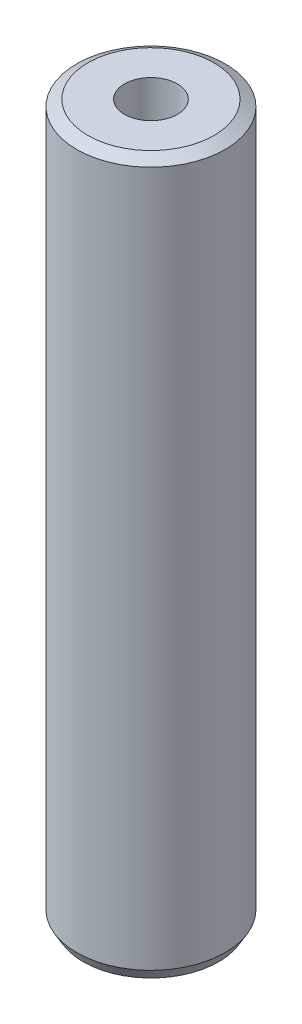
ISO-10303-21;
HEADER;
FILE_DESCRIPTION(('STEP AP214'),'2;1');
FILE_NAME('part.step','',(''),(''),'','','');
FILE_SCHEMA(('AUTOMOTIVE_DESIGN { 1 0 10303 214 1 1 1 1 }'));
ENDSEC;
DATA;
#1=APPLICATION_CONTEXT('core data for automotive mechanical design processes');
#2=APPLICATION_PROTOCOL_DEFINITION('international standard','automotive_design',2000,#1);
#3=PRODUCT_CONTEXT('',#1,'mechanical');
#4=PRODUCT('Part','Part','',(#3));
#5=PRODUCT_RELATED_PRODUCT_CATEGORY('part','',(#4));
#6=PRODUCT_DEFINITION_FORMATION('','',#4);
#7=PRODUCT_DEFINITION_CONTEXT('part definition',#1,'design');
#8=PRODUCT_DEFINITION('design','',#6,#7);
#9=PRODUCT_DEFINITION_SHAPE('','',#8);
#10=(LENGTH_UNIT() NAMED_UNIT(*) SI_UNIT(.MILLI.,.METRE.));
#11=(NAMED_UNIT(*) PLANE_ANGLE_UNIT() SI_UNIT($,.RADIAN.));
#12=(NAMED_UNIT(*) SI_UNIT($,.STERADIAN.) SOLID_ANGLE_UNIT());
#13=UNCERTAINTY_MEASURE_WITH_UNIT(LENGTH_MEASURE(1.E-05),#10,'distance_accuracy_value','');
#14=(GEOMETRIC_REPRESENTATION_CONTEXT(3) GLOBAL_UNCERTAINTY_ASSIGNED_CONTEXT((#13)) GLOBAL_UNIT_ASSIGNED_CONTEXT((#10,
#11,#12)) REPRESENTATION_CONTEXT('',''));
#15=CARTESIAN_POINT('',(0.,0.,0.));
#16=DIRECTION('',(0.,0.,1.));
#17=DIRECTION('',(1.,0.,0.));
#18=AXIS2_PLACEMENT_3D('',#15,#16,#17);
#19=CARTESIAN_POINT('',(0.,120.063627584823,0.));
#20=DIRECTION('',(0.,-1.,0.));
#21=DIRECTION('',(0.,0.,-1.));
#22=AXIS2_PLACEMENT_3D('',#19,#20,#21);
#23=CYLINDRICAL_SURFACE('',#22,12.5);
#24=CARTESIAN_POINT('',(0.,118.971869831638,0.));
#25=DIRECTION('',(0.,1.,0.));
#26=DIRECTION('',(0.,0.,1.));
#27=AXIS2_PLACEMENT_3D('',#24,#25,#26);
#28=CIRCLE('',#27,12.5);
#29=CARTESIAN_POINT('',(0.,118.971869831638,12.5));
#30=VERTEX_POINT('',#29);
#31=EDGE_CURVE('E50',#30,#30,#28,.F.);
#32=ORIENTED_EDGE('',*,*,#31,.T.);
#33=EDGE_LOOP('',(#32));
#34=FACE_BOUND('',#33,.T.);
#35=CARTESIAN_POINT('',(0.,1.89097989807455,0.));
#36=DIRECTION('',(0.,1.,0.));
#37=DIRECTION('',(0.,0.,1.));
#38=AXIS2_PLACEMENT_3D('',#35,#36,#37);
#39=CIRCLE('',#38,12.5);
#40=CARTESIAN_POINT('',(0.,1.89097989807455,12.5));
#41=VERTEX_POINT('',#40);
#42=EDGE_CURVE('E51',#41,#41,#39,.T.);
#43=ORIENTED_EDGE('',*,*,#42,.T.);
#44=EDGE_LOOP('',(#43));
#45=FACE_BOUND('',#44,.T.);
#46=ADVANCED_FACE('F39',(#34,#45),#23,.T.);
#47=CARTESIAN_POINT('',(0.,120.063627584823,0.));
#48=DIRECTION('',(0.,1.,0.));
#49=DIRECTION('',(0.,0.,1.));
#50=AXIS2_PLACEMENT_3D('',#47,#48,#49);
#51=PLANE('',#50);
#52=CARTESIAN_POINT('',(0.,120.063627584823,0.));
#53=DIRECTION('',(0.,1.,0.));
#54=DIRECTION('',(0.,0.,1.));
#55=AXIS2_PLACEMENT_3D('',#52,#53,#54);
#56=CIRCLE('',#55,10.6090201019255);
#57=CARTESIAN_POINT('',(0.,120.063627584823,10.6090201019255));
#58=VERTEX_POINT('',#57);
#59=EDGE_CURVE('E54',#58,#58,#56,.T.);
#60=ORIENTED_EDGE('',*,*,#59,.T.);
#61=EDGE_LOOP('',(#60));
#62=FACE_BOUND('',#61,.T.);
#63=CARTESIAN_POINT('',(0.,120.063627584823,0.));
#64=DIRECTION('',(0.,1.,0.));
#65=DIRECTION('',(0.,0.,1.));
#66=AXIS2_PLACEMENT_3D('',#63,#64,#65);
#67=CIRCLE('',#66,4.45143749131211);
#68=CARTESIAN_POINT('',(0.,120.063627584823,4.45143749131211));
#69=VERTEX_POINT('',#68);
#70=EDGE_CURVE('E58',#69,#69,#67,.T.);
#71=ORIENTED_EDGE('',*,*,#70,.F.);
#72=EDGE_LOOP('',(#71));
#73=FACE_BOUND('',#72,.T.);
#74=ADVANCED_FACE('F69',(#62,#73),#51,.T.);
#75=CARTESIAN_POINT('',(0.,0.,0.));
#76=DIRECTION('',(0.,1.,0.));
#77=DIRECTION('',(0.,0.,1.));
#78=AXIS2_PLACEMENT_3D('',#75,#76,#77);
#79=PLANE('',#78);
#80=CARTESIAN_POINT('',(0.,0.,0.));
#81=DIRECTION('',(0.,1.,0.));
#82=DIRECTION('',(0.,0.,1.));
#83=AXIS2_PLACEMENT_3D('',#80,#81,#82);
#84=CIRCLE('',#83,11.4082422468145);
#85=CARTESIAN_POINT('',(0.,0.,11.4082422468145));
#86=VERTEX_POINT('',#85);
#87=EDGE_CURVE('E10',#86,#86,#84,.F.);
#88=ORIENTED_EDGE('',*,*,#87,.T.);
#89=EDGE_LOOP('',(#88));
#90=FACE_BOUND('',#89,.T.);
#91=CARTESIAN_POINT('',(0.,0.,0.));
#92=DIRECTION('',(0.,1.,0.));
#93=DIRECTION('',(0.,0.,1.));
#94=AXIS2_PLACEMENT_3D('',#91,#92,#93);
#95=CIRCLE('',#94,4.45143749131211);
#96=CARTESIAN_POINT('',(0.,0.,4.45143749131211));
#97=VERTEX_POINT('',#96);
#98=EDGE_CURVE('E63',#97,#97,#95,.T.);
#99=ORIENTED_EDGE('',*,*,#98,.T.);
#100=EDGE_LOOP('',(#99));
#101=FACE_BOUND('',#100,.T.);
#102=ADVANCED_FACE('F75',(#90,#101),#79,.F.);
#103=CARTESIAN_POINT('',(0.,120.063627584823,0.));
#104=DIRECTION('',(0.,-1.,0.));
#105=DIRECTION('',(0.,0.,-1.));
#106=AXIS2_PLACEMENT_3D('',#103,#104,#105);
#107=CYLINDRICAL_SURFACE('',#106,4.45143749131211);
#108=ORIENTED_EDGE('',*,*,#70,.T.);
#109=EDGE_LOOP('',(#108));
#110=FACE_BOUND('',#109,.T.);
#111=ORIENTED_EDGE('',*,*,#98,.F.);
#112=EDGE_LOOP('',(#111));
#113=FACE_BOUND('',#112,.T.);
#114=ADVANCED_FACE('F70',(#110,#113),#107,.F.);
#115=CARTESIAN_POINT('',(0.,120.063627584823,0.));
#116=DIRECTION('',(0.,-1.,0.));
#117=DIRECTION('',(0.,0.,-1.));
#118=AXIS2_PLACEMENT_3D('',#115,#116,#117);
#119=CONICAL_SURFACE('',#118,10.6090201019255,1.0471975511966);
#120=ORIENTED_EDGE('',*,*,#31,.F.);
#121=EDGE_LOOP('',(#120));
#122=FACE_BOUND('',#121,.T.);
#123=ORIENTED_EDGE('',*,*,#59,.F.);
#124=EDGE_LOOP('',(#123));
#125=FACE_BOUND('',#124,.T.);
#126=ADVANCED_FACE('F81',(#122,#125),#119,.T.);
#127=CARTESIAN_POINT('',(0.,1.89097989807455,0.));
#128=DIRECTION('',(0.,1.,0.));
#129=DIRECTION('',(0.,0.,1.));
#130=AXIS2_PLACEMENT_3D('',#127,#128,#129);
#131=CONICAL_SURFACE('',#130,12.5,0.523598775598301);
#132=CARTESIAN_POINT('',(0.,0.,11.4082422468145));
#133=CARTESIAN_POINT('',(0.,0.0196977072716098,11.4196147234102));
#134=CARTESIAN_POINT('',(0.,0.0393954145432196,11.4309872000058));
#135=CARTESIAN_POINT('',(0.,0.0787908290864393,11.4537321531972));
#136=CARTESIAN_POINT('',(0.,0.0984885363580491,11.4651046297929));
#137=CARTESIAN_POINT('',(0.,0.137883950901269,11.4878495829843));
#138=CARTESIAN_POINT('',(0.,0.157581658172878,11.4992220595799));
#139=CARTESIAN_POINT('',(0.,0.196977072716098,11.5219670127713));
#140=CARTESIAN_POINT('',(0.,0.216674779987708,11.533339489367));
#141=CARTESIAN_POINT('',(0.,0.256070194530928,11.5560844425584));
#142=CARTESIAN_POINT('',(0.,0.275767901802538,11.567456919154));
#143=CARTESIAN_POINT('',(0.,0.315163316345757,11.5902018723454));
#144=CARTESIAN_POINT('',(0.,0.334861023617367,11.6015743489411));
#145=CARTESIAN_POINT('',(0.,0.374256438160587,11.6243193021325));
#146=CARTESIAN_POINT('',(0.,0.393954145432197,11.6356917787281));
#147=CARTESIAN_POINT('',(0.,0.433349559975416,11.6584367319195));
#148=CARTESIAN_POINT('',(0.,0.453047267247027,11.6698092085152));
#149=CARTESIAN_POINT('',(0.,0.492442681790246,11.6925541617065));
#150=CARTESIAN_POINT('',(0.,0.512140389061856,11.7039266383022));
#151=CARTESIAN_POINT('',(0.,0.551535803605076,11.7266715914936));
#152=CARTESIAN_POINT('',(0.,0.571233510876686,11.7380440680893));
#153=CARTESIAN_POINT('',(0.,0.610628925419905,11.7607890212806));
#154=CARTESIAN_POINT('',(0.,0.630326632691515,11.7721614978763));
#155=CARTESIAN_POINT('',(0.,0.669722047234735,11.7949064510677));
#156=CARTESIAN_POINT('',(0.,0.689419754506345,11.8062789276634));
#157=CARTESIAN_POINT('',(0.,0.728815169049564,11.8290238808547));
#158=CARTESIAN_POINT('',(0.,0.748512876321174,11.8403963574504));
#159=CARTESIAN_POINT('',(0.,0.787908290864394,11.8631413106418));
#160=CARTESIAN_POINT('',(0.,0.807605998136004,11.8745137872375));
#161=CARTESIAN_POINT('',(0.,0.847001412679223,11.8972587404288));
#162=CARTESIAN_POINT('',(0.,0.866699119950833,11.9086312170245));
#163=CARTESIAN_POINT('',(0.,0.906094534494053,11.9313761702159));
#164=CARTESIAN_POINT('',(0.,0.925792241765663,11.9427486468116));
#165=CARTESIAN_POINT('',(0.,0.965187656308883,11.9654936000029));
#166=CARTESIAN_POINT('',(0.,0.984885363580493,11.9768660765986));
#167=CARTESIAN_POINT('',(0.,1.02428077812371,11.99961102979));
#168=CARTESIAN_POINT('',(0.,1.04397848539532,12.0109835063857));
#169=CARTESIAN_POINT('',(0.,1.08337389993854,12.033728459577));
#170=CARTESIAN_POINT('',(0.,1.10307160721015,12.0451009361727));
#171=CARTESIAN_POINT('',(0.,1.14246702175337,12.0678458893641));
#172=CARTESIAN_POINT('',(0.,1.16216472902498,12.0792183659597));
#173=CARTESIAN_POINT('',(0.,1.2015601435682,12.1019633191511));
#174=CARTESIAN_POINT('',(0.,1.22125785083981,12.1133357957468));
#175=CARTESIAN_POINT('',(0.,1.26065326538303,12.1360807489382));
#176=CARTESIAN_POINT('',(0.,1.28035097265464,12.1474532255338));
#177=CARTESIAN_POINT('',(0.,1.31974638719786,12.1701981787252));
#178=CARTESIAN_POINT('',(0.,1.33944409446947,12.1815706553209));
#179=CARTESIAN_POINT('',(0.,1.37883950901269,12.2043156085123));
#180=CARTESIAN_POINT('',(0.,1.3985372162843,12.2156880851079));
#181=CARTESIAN_POINT('',(0.,1.43793263082752,12.2384330382993));
#182=CARTESIAN_POINT('',(0.,1.45763033809913,12.249805514895));
#183=CARTESIAN_POINT('',(0.,1.49702575264235,12.2725504680864));
#184=CARTESIAN_POINT('',(0.,1.51672345991396,12.283922944682));
#185=CARTESIAN_POINT('',(0.,1.55611887445718,12.3066678978734));
#186=CARTESIAN_POINT('',(0.,1.57581658172879,12.3180403744691));
#187=CARTESIAN_POINT('',(0.,1.61521199627201,12.3407853276604));
#188=CARTESIAN_POINT('',(0.,1.63490970354362,12.3521578042561));
#189=CARTESIAN_POINT('',(0.,1.67430511808684,12.3749027574475));
#190=CARTESIAN_POINT('',(0.,1.69400282535845,12.3862752340432));
#191=CARTESIAN_POINT('',(0.,1.73339823990167,12.4090201872345));
#192=CARTESIAN_POINT('',(0.,1.75309594717328,12.4203926638302));
#193=CARTESIAN_POINT('',(0.,1.7924913617165,12.4431376170216));
#194=CARTESIAN_POINT('',(0.,1.81218906898811,12.4545100936173));
#195=CARTESIAN_POINT('',(0.,1.85158448353133,12.4772550468086));
#196=CARTESIAN_POINT('',(0.,1.87128219080294,12.4886275234043));
#197=CARTESIAN_POINT('',(0.,1.89097989807455,12.5));
#198=B_SPLINE_CURVE_WITH_KNOTS('',3,(#132,#133,#134,#135,#136,#137,#138,#139,#140,#141,#142,
#143,#144,#145,#146,#147,#148,#149,#150,#151,#152,#153,#154,#155,#156,#157,#158,#159,#160,#161,
#162,#163,#164,#165,#166,#167,#168,#169,#170,#171,#172,#173,#174,#175,#176,#177,#178,#179,#180,
#181,#182,#183,#184,#185,#186,#187,#188,#189,#190,#191,#192,#193,#194,#195,#196,#197),
.UNSPECIFIED.,.F.,.F.,(4,2,2,2,2,2,2,2,2,2,2,2,2,2,2,2,2,2,2,2,2,2,2,2,2,2,2,2,2,2,2,2,4),(0.,
0.068234859574094,0.136469719148189,0.204704578722284,0.272939438296378,0.341174297870473,
0.409409157444567,0.477644017018661,0.545878876592755,0.61411373616685,0.682348595740945,
0.750583455315039,0.818818314889134,0.887053174463228,0.955288034037323,1.02352289361142,
1.09175775318551,1.15999261275961,1.2282274723337,1.2964623319078,1.36469719148189,
1.43293205105599,1.50116691063008,1.56940177020417,1.63763662977827,1.70587148935236,
1.77410634892646,1.84234120850055,1.91057606807465,1.97881092764874,2.04704578722284,
2.11528064679693,2.18351550637102),.UNSPECIFIED.);
#199=EDGE_CURVE('BSEAM45',#86,#41,#198,.T.);
#200=ORIENTED_EDGE('',*,*,#87,.F.);
#201=ORIENTED_EDGE('',*,*,#42,.F.);
#202=ORIENTED_EDGE('',*,*,#199,.T.);
#203=ORIENTED_EDGE('',*,*,#199,.F.);
#204=EDGE_LOOP('',(#200,#202,#201,#203));
#205=FACE_BOUND('',#204,.T.);
#206=ADVANCED_FACE('F45',(#205),#131,.T.);
#207=CLOSED_SHELL('',(#46,#74,#102,#114,#126,#206));
#208=MANIFOLD_SOLID_BREP('B2',#207);
#209=ADVANCED_BREP_SHAPE_REPRESENTATION('',(#18,#208),#14);
#210=SHAPE_DEFINITION_REPRESENTATION(#9,#209);
ENDSEC;
END-ISO-10303-21;
